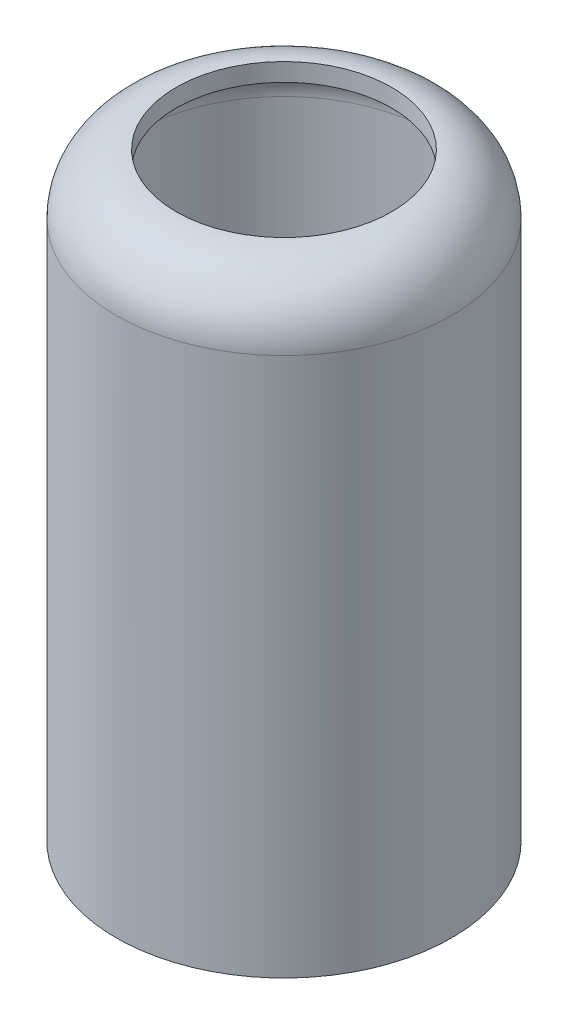
ISO-10303-21;
HEADER;
FILE_DESCRIPTION(('STEP AP214'),'2;1');
FILE_NAME('part.step','',(''),(''),'','','');
FILE_SCHEMA(('AUTOMOTIVE_DESIGN { 1 0 10303 214 1 1 1 1 }'));
ENDSEC;
DATA;
#1=APPLICATION_CONTEXT('core data for automotive mechanical design processes');
#2=APPLICATION_PROTOCOL_DEFINITION('international standard','automotive_design',2000,#1);
#3=PRODUCT_CONTEXT('',#1,'mechanical');
#4=PRODUCT('Part','Part','',(#3));
#5=PRODUCT_RELATED_PRODUCT_CATEGORY('part','',(#4));
#6=PRODUCT_DEFINITION_FORMATION('','',#4);
#7=PRODUCT_DEFINITION_CONTEXT('part definition',#1,'design');
#8=PRODUCT_DEFINITION('design','',#6,#7);
#9=PRODUCT_DEFINITION_SHAPE('','',#8);
#10=(LENGTH_UNIT() NAMED_UNIT(*) SI_UNIT(.MILLI.,.METRE.));
#11=(NAMED_UNIT(*) PLANE_ANGLE_UNIT() SI_UNIT($,.RADIAN.));
#12=(NAMED_UNIT(*) SI_UNIT($,.STERADIAN.) SOLID_ANGLE_UNIT());
#13=UNCERTAINTY_MEASURE_WITH_UNIT(LENGTH_MEASURE(1.E-05),#10,'distance_accuracy_value','');
#14=(GEOMETRIC_REPRESENTATION_CONTEXT(3) GLOBAL_UNCERTAINTY_ASSIGNED_CONTEXT((#13)) GLOBAL_UNIT_ASSIGNED_CONTEXT((#10,
#11,#12)) REPRESENTATION_CONTEXT('',''));
#15=CARTESIAN_POINT('',(0.,0.,0.));
#16=DIRECTION('',(0.,0.,1.));
#17=DIRECTION('',(1.,0.,0.));
#18=AXIS2_PLACEMENT_3D('',#15,#16,#17);
#19=CARTESIAN_POINT('',(0.,100.,0.));
#20=DIRECTION('',(0.,-1.,0.));
#21=DIRECTION('',(0.,0.,-1.));
#22=AXIS2_PLACEMENT_3D('',#19,#20,#21);
#23=CYLINDRICAL_SURFACE('',#22,28.);
#24=CARTESIAN_POINT('',(0.,90.,0.));
#25=DIRECTION('',(0.,1.,0.));
#26=DIRECTION('',(0.,0.,1.));
#27=AXIS2_PLACEMENT_3D('',#24,#25,#26);
#28=CIRCLE('',#27,28.);
#29=CARTESIAN_POINT('',(0.,90.,-28.));
#30=VERTEX_POINT('',#29);
#31=EDGE_CURVE('E10',#30,#30,#28,.F.);
#32=CARTESIAN_POINT('',(0.,0.,0.));
#33=DIRECTION('',(0.,1.,0.));
#34=DIRECTION('',(0.,0.,1.));
#35=AXIS2_PLACEMENT_3D('',#32,#33,#34);
#36=CIRCLE('',#35,28.);
#37=CARTESIAN_POINT('',(0.,0.,-28.));
#38=VERTEX_POINT('',#37);
#39=EDGE_CURVE('E37',#38,#38,#36,.T.);
#40=CARTESIAN_POINT('',(0.,90.,-28.));
#41=CARTESIAN_POINT('',(0.,89.0625,-28.));
#42=CARTESIAN_POINT('',(0.,88.125,-28.));
#43=CARTESIAN_POINT('',(0.,86.25,-28.));
#44=CARTESIAN_POINT('',(0.,85.3125,-28.));
#45=CARTESIAN_POINT('',(0.,83.4375,-28.));
#46=CARTESIAN_POINT('',(0.,82.5,-28.));
#47=CARTESIAN_POINT('',(0.,80.625,-28.));
#48=CARTESIAN_POINT('',(0.,79.6875,-28.));
#49=CARTESIAN_POINT('',(0.,77.8125,-28.));
#50=CARTESIAN_POINT('',(0.,76.875,-28.));
#51=CARTESIAN_POINT('',(0.,75.,-28.));
#52=CARTESIAN_POINT('',(0.,74.0625,-28.));
#53=CARTESIAN_POINT('',(0.,72.1875,-28.));
#54=CARTESIAN_POINT('',(0.,71.25,-28.));
#55=CARTESIAN_POINT('',(0.,69.375,-28.));
#56=CARTESIAN_POINT('',(0.,68.4375,-28.));
#57=CARTESIAN_POINT('',(0.,66.5625,-28.));
#58=CARTESIAN_POINT('',(0.,65.625,-28.));
#59=CARTESIAN_POINT('',(0.,63.75,-28.));
#60=CARTESIAN_POINT('',(0.,62.8125,-28.));
#61=CARTESIAN_POINT('',(0.,60.9375,-28.));
#62=CARTESIAN_POINT('',(0.,60.,-28.));
#63=CARTESIAN_POINT('',(0.,58.125,-28.));
#64=CARTESIAN_POINT('',(0.,57.1875,-28.));
#65=CARTESIAN_POINT('',(0.,55.3125,-28.));
#66=CARTESIAN_POINT('',(0.,54.375,-28.));
#67=CARTESIAN_POINT('',(0.,52.5,-28.));
#68=CARTESIAN_POINT('',(0.,51.5625,-28.));
#69=CARTESIAN_POINT('',(0.,49.6875,-28.));
#70=CARTESIAN_POINT('',(0.,48.75,-28.));
#71=CARTESIAN_POINT('',(0.,46.875,-28.));
#72=CARTESIAN_POINT('',(0.,45.9375,-28.));
#73=CARTESIAN_POINT('',(0.,44.0625,-28.));
#74=CARTESIAN_POINT('',(0.,43.125,-28.));
#75=CARTESIAN_POINT('',(0.,41.25,-28.));
#76=CARTESIAN_POINT('',(0.,40.3125,-28.));
#77=CARTESIAN_POINT('',(0.,38.4375,-28.));
#78=CARTESIAN_POINT('',(0.,37.5,-28.));
#79=CARTESIAN_POINT('',(0.,35.625,-28.));
#80=CARTESIAN_POINT('',(0.,34.6875,-28.));
#81=CARTESIAN_POINT('',(0.,32.8125,-28.));
#82=CARTESIAN_POINT('',(0.,31.875,-28.));
#83=CARTESIAN_POINT('',(0.,30.,-28.));
#84=CARTESIAN_POINT('',(0.,29.0625,-28.));
#85=CARTESIAN_POINT('',(0.,27.1875,-28.));
#86=CARTESIAN_POINT('',(0.,26.25,-28.));
#87=CARTESIAN_POINT('',(0.,24.375,-28.));
#88=CARTESIAN_POINT('',(0.,23.4375,-28.));
#89=CARTESIAN_POINT('',(0.,21.5625,-28.));
#90=CARTESIAN_POINT('',(0.,20.625,-28.));
#91=CARTESIAN_POINT('',(0.,18.75,-28.));
#92=CARTESIAN_POINT('',(0.,17.8125,-28.));
#93=CARTESIAN_POINT('',(0.,15.9375,-28.));
#94=CARTESIAN_POINT('',(0.,15.,-28.));
#95=CARTESIAN_POINT('',(0.,13.125,-28.));
#96=CARTESIAN_POINT('',(0.,12.1875,-28.));
#97=CARTESIAN_POINT('',(0.,10.3125,-28.));
#98=CARTESIAN_POINT('',(0.,9.375,-28.));
#99=CARTESIAN_POINT('',(0.,7.5,-28.));
#100=CARTESIAN_POINT('',(0.,6.5625,-28.));
#101=CARTESIAN_POINT('',(0.,4.6875,-28.));
#102=CARTESIAN_POINT('',(0.,3.75,-28.));
#103=CARTESIAN_POINT('',(0.,1.875,-28.));
#104=CARTESIAN_POINT('',(0.,0.9375,-28.));
#105=CARTESIAN_POINT('',(0.,0.,-28.));
#106=B_SPLINE_CURVE_WITH_KNOTS('',3,(#40,#41,#42,#43,#44,#45,#46,#47,#48,#49,#50,#51,#52,#53,
#54,#55,#56,#57,#58,#59,#60,#61,#62,#63,#64,#65,#66,#67,#68,#69,#70,#71,#72,#73,#74,#75,#76,#77,
#78,#79,#80,#81,#82,#83,#84,#85,#86,#87,#88,#89,#90,#91,#92,#93,#94,#95,#96,#97,#98,#99,#100,
#101,#102,#103,#104,#105),.UNSPECIFIED.,.F.,.F.,(4,2,2,2,2,2,2,2,2,2,2,2,2,2,2,2,2,2,2,2,2,2,2,
2,2,2,2,2,2,2,2,2,4),(0.,2.8125,5.62499999999999,8.4375,11.25,14.0625,16.875,19.6875,22.5,
25.3125,28.125,30.9375,33.75,36.5625,39.375,42.1875,45.,47.8125,50.625,53.4375,56.25,59.0625,
61.875,64.6875,67.5,70.3125,73.125,75.9375,78.75,81.5625,84.375,87.1875,90.),.UNSPECIFIED.);
#107=EDGE_CURVE('BSEAM30',#30,#38,#106,.T.);
#108=ORIENTED_EDGE('',*,*,#31,.T.);
#109=ORIENTED_EDGE('',*,*,#39,.T.);
#110=ORIENTED_EDGE('',*,*,#107,.T.);
#111=ORIENTED_EDGE('',*,*,#107,.F.);
#112=EDGE_LOOP('',(#108,#110,#109,#111));
#113=FACE_BOUND('',#112,.T.);
#114=ADVANCED_FACE('F30',(#113),#23,.T.);
#115=CARTESIAN_POINT('',(0.,0.,0.));
#116=DIRECTION('',(0.,1.,0.));
#117=DIRECTION('',(0.,0.,1.));
#118=AXIS2_PLACEMENT_3D('',#115,#116,#117);
#119=PLANE('',#118);
#120=ORIENTED_EDGE('',*,*,#39,.F.);
#121=EDGE_LOOP('',(#120));
#122=FACE_BOUND('',#121,.T.);
#123=ADVANCED_FACE('F61',(#122),#119,.F.);
#124=CARTESIAN_POINT('',(0.,90.,0.));
#125=DIRECTION('',(0.,1.,0.));
#126=DIRECTION('',(0.,0.,1.));
#127=AXIS2_PLACEMENT_3D('',#124,#125,#126);
#128=TOROIDAL_SURFACE('',#127,18.,10.);
#129=ORIENTED_EDGE('',*,*,#31,.F.);
#130=EDGE_LOOP('',(#129));
#131=FACE_BOUND('',#130,.T.);
#132=CARTESIAN_POINT('',(0.,100.,0.));
#133=DIRECTION('',(0.,1.,0.));
#134=DIRECTION('',(0.,0.,1.));
#135=AXIS2_PLACEMENT_3D('',#132,#133,#134);
#136=CIRCLE('',#135,18.);
#137=CARTESIAN_POINT('',(0.,100.,18.));
#138=VERTEX_POINT('',#137);
#139=EDGE_CURVE('E51',#138,#138,#136,.T.);
#140=ORIENTED_EDGE('',*,*,#139,.F.);
#141=EDGE_LOOP('',(#140));
#142=FACE_BOUND('',#141,.T.);
#143=ADVANCED_FACE('F32',(#131,#142),#128,.T.);
#144=CARTESIAN_POINT('',(0.,100.,0.));
#145=DIRECTION('',(0.,1.,0.));
#146=DIRECTION('',(0.,0.,1.));
#147=AXIS2_PLACEMENT_3D('',#144,#145,#146);
#148=CYLINDRICAL_SURFACE('',#147,18.);
#149=ORIENTED_EDGE('',*,*,#139,.T.);
#150=EDGE_LOOP('',(#149));
#151=FACE_BOUND('',#150,.T.);
#152=CARTESIAN_POINT('',(0.,97.,0.));
#153=DIRECTION('',(0.,-1.,0.));
#154=DIRECTION('',(0.,0.,-1.));
#155=AXIS2_PLACEMENT_3D('',#152,#153,#154);
#156=CIRCLE('',#155,18.);
#157=CARTESIAN_POINT('',(0.,97.,-18.));
#158=VERTEX_POINT('',#157);
#159=EDGE_CURVE('E41',#158,#158,#156,.F.);
#160=ORIENTED_EDGE('',*,*,#159,.F.);
#161=EDGE_LOOP('',(#160));
#162=FACE_BOUND('',#161,.T.);
#163=ADVANCED_FACE('F57',(#151,#162),#148,.F.);
#164=CARTESIAN_POINT('',(0.,100.,0.));
#165=DIRECTION('',(0.,-1.,0.));
#166=DIRECTION('',(0.,0.,-1.));
#167=AXIS2_PLACEMENT_3D('',#164,#165,#166);
#168=CYLINDRICAL_SURFACE('',#167,25.);
#169=CARTESIAN_POINT('',(0.,90.,0.));
#170=DIRECTION('',(0.,-1.,0.));
#171=DIRECTION('',(0.,0.,-1.));
#172=AXIS2_PLACEMENT_3D('',#169,#170,#171);
#173=CIRCLE('',#172,25.);
#174=CARTESIAN_POINT('',(0.,90.,-25.));
#175=VERTEX_POINT('',#174);
#176=EDGE_CURVE('E45',#175,#175,#173,.T.);
#177=CARTESIAN_POINT('',(0.,3.,0.));
#178=DIRECTION('',(0.,1.,0.));
#179=DIRECTION('',(0.,0.,1.));
#180=AXIS2_PLACEMENT_3D('',#177,#178,#179);
#181=CIRCLE('',#180,25.);
#182=CARTESIAN_POINT('',(0.,3.,-25.));
#183=VERTEX_POINT('',#182);
#184=EDGE_CURVE('E48',#183,#183,#181,.T.);
#185=CARTESIAN_POINT('',(0.,90.,-25.));
#186=CARTESIAN_POINT('',(0.,89.09375,-25.));
#187=CARTESIAN_POINT('',(0.,88.1875,-25.));
#188=CARTESIAN_POINT('',(0.,86.375,-25.));
#189=CARTESIAN_POINT('',(0.,85.46875,-25.));
#190=CARTESIAN_POINT('',(0.,83.65625,-25.));
#191=CARTESIAN_POINT('',(0.,82.75,-25.));
#192=CARTESIAN_POINT('',(0.,80.9375,-25.));
#193=CARTESIAN_POINT('',(0.,80.03125,-25.));
#194=CARTESIAN_POINT('',(0.,78.21875,-25.));
#195=CARTESIAN_POINT('',(0.,77.3125,-25.));
#196=CARTESIAN_POINT('',(0.,75.5,-25.));
#197=CARTESIAN_POINT('',(0.,74.59375,-25.));
#198=CARTESIAN_POINT('',(0.,72.78125,-25.));
#199=CARTESIAN_POINT('',(0.,71.875,-25.));
#200=CARTESIAN_POINT('',(0.,70.0625,-25.));
#201=CARTESIAN_POINT('',(0.,69.15625,-25.));
#202=CARTESIAN_POINT('',(0.,67.34375,-25.));
#203=CARTESIAN_POINT('',(0.,66.4375,-25.));
#204=CARTESIAN_POINT('',(0.,64.625,-25.));
#205=CARTESIAN_POINT('',(0.,63.71875,-25.));
#206=CARTESIAN_POINT('',(0.,61.90625,-25.));
#207=CARTESIAN_POINT('',(0.,61.,-25.));
#208=CARTESIAN_POINT('',(0.,59.1875,-25.));
#209=CARTESIAN_POINT('',(0.,58.28125,-25.));
#210=CARTESIAN_POINT('',(0.,56.46875,-25.));
#211=CARTESIAN_POINT('',(0.,55.5625,-25.));
#212=CARTESIAN_POINT('',(0.,53.75,-25.));
#213=CARTESIAN_POINT('',(0.,52.84375,-25.));
#214=CARTESIAN_POINT('',(0.,51.03125,-25.));
#215=CARTESIAN_POINT('',(0.,50.125,-25.));
#216=CARTESIAN_POINT('',(0.,48.3125,-25.));
#217=CARTESIAN_POINT('',(0.,47.40625,-25.));
#218=CARTESIAN_POINT('',(0.,45.59375,-25.));
#219=CARTESIAN_POINT('',(0.,44.6875,-25.));
#220=CARTESIAN_POINT('',(0.,42.875,-25.));
#221=CARTESIAN_POINT('',(0.,41.96875,-25.));
#222=CARTESIAN_POINT('',(0.,40.15625,-25.));
#223=CARTESIAN_POINT('',(0.,39.25,-25.));
#224=CARTESIAN_POINT('',(0.,37.4375,-25.));
#225=CARTESIAN_POINT('',(0.,36.53125,-25.));
#226=CARTESIAN_POINT('',(0.,34.71875,-25.));
#227=CARTESIAN_POINT('',(0.,33.8125,-25.));
#228=CARTESIAN_POINT('',(0.,32.,-25.));
#229=CARTESIAN_POINT('',(0.,31.09375,-25.));
#230=CARTESIAN_POINT('',(0.,29.28125,-25.));
#231=CARTESIAN_POINT('',(0.,28.375,-25.));
#232=CARTESIAN_POINT('',(0.,26.5625,-25.));
#233=CARTESIAN_POINT('',(0.,25.65625,-25.));
#234=CARTESIAN_POINT('',(0.,23.84375,-25.));
#235=CARTESIAN_POINT('',(0.,22.9375,-25.));
#236=CARTESIAN_POINT('',(0.,21.125,-25.));
#237=CARTESIAN_POINT('',(0.,20.21875,-25.));
#238=CARTESIAN_POINT('',(0.,18.40625,-25.));
#239=CARTESIAN_POINT('',(0.,17.5,-25.));
#240=CARTESIAN_POINT('',(0.,15.6875,-25.));
#241=CARTESIAN_POINT('',(0.,14.78125,-25.));
#242=CARTESIAN_POINT('',(0.,12.96875,-25.));
#243=CARTESIAN_POINT('',(0.,12.0625,-25.));
#244=CARTESIAN_POINT('',(0.,10.25,-25.));
#245=CARTESIAN_POINT('',(0.,9.34374999999999,-25.));
#246=CARTESIAN_POINT('',(0.,7.53124999999999,-25.));
#247=CARTESIAN_POINT('',(0.,6.62499999999999,-25.));
#248=CARTESIAN_POINT('',(0.,4.8125,-25.));
#249=CARTESIAN_POINT('',(0.,3.90625,-25.));
#250=CARTESIAN_POINT('',(0.,3.,-25.));
#251=B_SPLINE_CURVE_WITH_KNOTS('',3,(#185,#186,#187,#188,#189,#190,#191,#192,#193,#194,#195,
#196,#197,#198,#199,#200,#201,#202,#203,#204,#205,#206,#207,#208,#209,#210,#211,#212,#213,#214,
#215,#216,#217,#218,#219,#220,#221,#222,#223,#224,#225,#226,#227,#228,#229,#230,#231,#232,#233,
#234,#235,#236,#237,#238,#239,#240,#241,#242,#243,#244,#245,#246,#247,#248,#249,#250),
.UNSPECIFIED.,.F.,.F.,(4,2,2,2,2,2,2,2,2,2,2,2,2,2,2,2,2,2,2,2,2,2,2,2,2,2,2,2,2,2,2,2,4),(0.,
2.71875000000001,5.43750000000001,8.15625,10.875,13.59375,16.3125,19.03125,21.75,24.46875,
27.1875,29.90625,32.625,35.34375,38.0625,40.78125,43.5,46.21875,48.9375,51.65625,54.375,
57.09375,59.8125,62.53125,65.25,67.96875,70.6875,73.40625,76.125,78.84375,81.5625,84.28125,87.),.UNSPECIFIED.);
#252=EDGE_CURVE('BSEAM67',#175,#183,#251,.T.);
#253=ORIENTED_EDGE('',*,*,#176,.F.);
#254=ORIENTED_EDGE('',*,*,#184,.F.);
#255=ORIENTED_EDGE('',*,*,#252,.T.);
#256=ORIENTED_EDGE('',*,*,#252,.F.);
#257=EDGE_LOOP('',(#253,#255,#254,#256));
#258=FACE_BOUND('',#257,.T.);
#259=ADVANCED_FACE('F67',(#258),#168,.F.);
#260=CARTESIAN_POINT('',(0.,3.,0.));
#261=DIRECTION('',(0.,1.,0.));
#262=DIRECTION('',(0.,0.,1.));
#263=AXIS2_PLACEMENT_3D('',#260,#261,#262);
#264=PLANE('',#263);
#265=ORIENTED_EDGE('',*,*,#184,.T.);
#266=EDGE_LOOP('',(#265));
#267=FACE_BOUND('',#266,.T.);
#268=ADVANCED_FACE('F78',(#267),#264,.T.);
#269=CARTESIAN_POINT('',(0.,90.,0.));
#270=DIRECTION('',(0.,1.,0.));
#271=DIRECTION('',(0.,0.,1.));
#272=AXIS2_PLACEMENT_3D('',#269,#270,#271);
#273=TOROIDAL_SURFACE('',#272,18.,7.);
#274=ORIENTED_EDGE('',*,*,#176,.T.);
#275=EDGE_LOOP('',(#274));
#276=FACE_BOUND('',#275,.T.);
#277=ORIENTED_EDGE('',*,*,#159,.T.);
#278=EDGE_LOOP('',(#277));
#279=FACE_BOUND('',#278,.T.);
#280=ADVANCED_FACE('F75',(#276,#279),#273,.F.);
#281=CLOSED_SHELL('',(#114,#123,#143,#163,#259,#268,#280));
#282=MANIFOLD_SOLID_BREP('B2',#281);
#283=ADVANCED_BREP_SHAPE_REPRESENTATION('',(#18,#282),#14);
#284=SHAPE_DEFINITION_REPRESENTATION(#9,#283);
ENDSEC;
END-ISO-10303-21;
